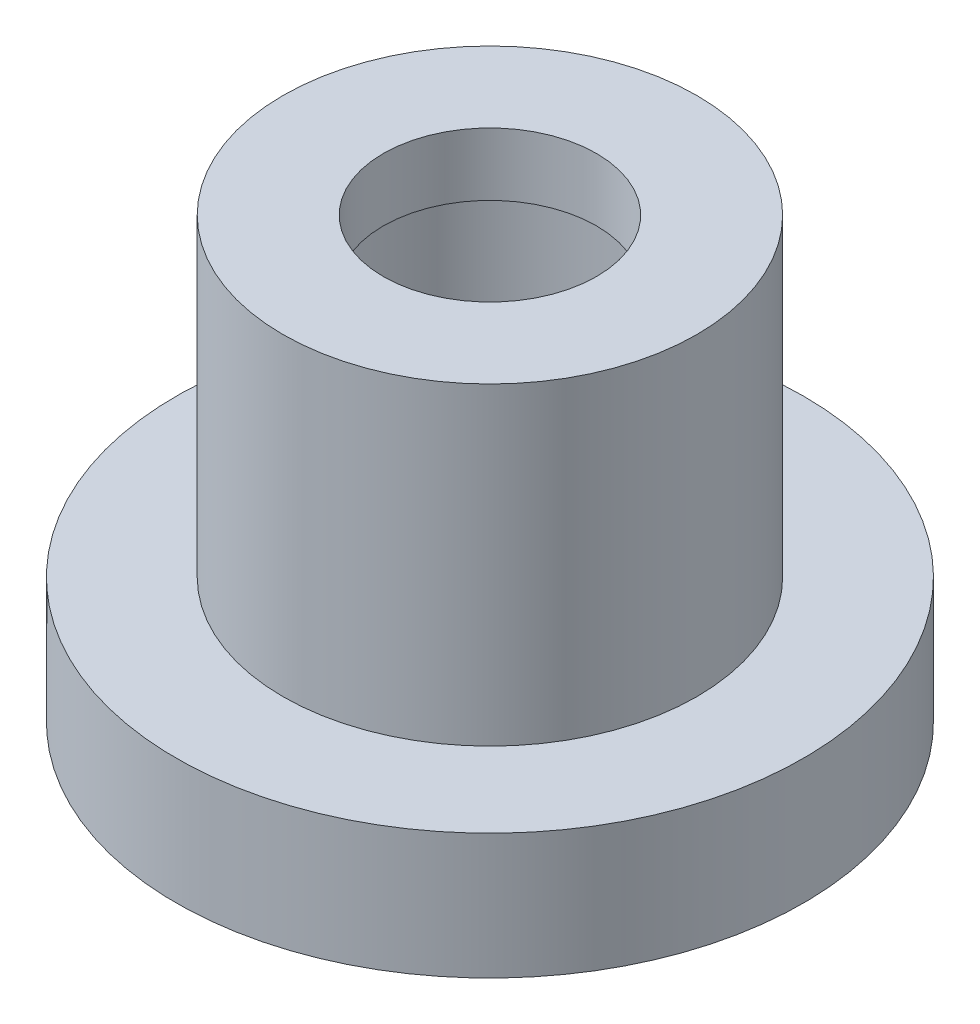
ISO-10303-21;
HEADER;
FILE_DESCRIPTION(('STEP AP214'),'2;1');
FILE_NAME('part.step','',(''),(''),'','','');
FILE_SCHEMA(('AUTOMOTIVE_DESIGN { 1 0 10303 214 1 1 1 1 }'));
ENDSEC;
DATA;
#1=APPLICATION_CONTEXT('core data for automotive mechanical design processes');
#2=APPLICATION_PROTOCOL_DEFINITION('international standard','automotive_design',2000,#1);
#3=PRODUCT_CONTEXT('',#1,'mechanical');
#4=PRODUCT('Part','Part','',(#3));
#5=PRODUCT_RELATED_PRODUCT_CATEGORY('part','',(#4));
#6=PRODUCT_DEFINITION_FORMATION('','',#4);
#7=PRODUCT_DEFINITION_CONTEXT('part definition',#1,'design');
#8=PRODUCT_DEFINITION('design','',#6,#7);
#9=PRODUCT_DEFINITION_SHAPE('','',#8);
#10=(LENGTH_UNIT() NAMED_UNIT(*) SI_UNIT(.MILLI.,.METRE.));
#11=(NAMED_UNIT(*) PLANE_ANGLE_UNIT() SI_UNIT($,.RADIAN.));
#12=(NAMED_UNIT(*) SI_UNIT($,.STERADIAN.) SOLID_ANGLE_UNIT());
#13=UNCERTAINTY_MEASURE_WITH_UNIT(LENGTH_MEASURE(1.E-05),#10,'distance_accuracy_value','');
#14=(GEOMETRIC_REPRESENTATION_CONTEXT(3) GLOBAL_UNCERTAINTY_ASSIGNED_CONTEXT((#13)) GLOBAL_UNIT_ASSIGNED_CONTEXT((#10,
#11,#12)) REPRESENTATION_CONTEXT('',''));
#15=CARTESIAN_POINT('',(0.,0.,0.));
#16=DIRECTION('',(0.,0.,1.));
#17=DIRECTION('',(1.,0.,0.));
#18=AXIS2_PLACEMENT_3D('',#15,#16,#17);
#19=CARTESIAN_POINT('',(0.,7.,0.));
#20=DIRECTION('',(0.,-1.,0.));
#21=DIRECTION('',(0.,0.,-1.));
#22=AXIS2_PLACEMENT_3D('',#19,#20,#21);
#23=CYLINDRICAL_SURFACE('',#22,2.3);
#24=CARTESIAN_POINT('',(0.,0.,0.));
#25=DIRECTION('',(0.,1.,0.));
#26=DIRECTION('',(0.,0.,1.));
#27=AXIS2_PLACEMENT_3D('',#24,#25,#26);
#28=CIRCLE('',#27,2.3);
#29=CARTESIAN_POINT('',(0.,0.,2.3));
#30=VERTEX_POINT('',#29);
#31=EDGE_CURVE('E52',#30,#30,#28,.T.);
#32=ORIENTED_EDGE('',*,*,#31,.F.);
#33=EDGE_LOOP('',(#32));
#34=FACE_BOUND('',#33,.T.);
#35=CARTESIAN_POINT('',(0.,6.,0.));
#36=DIRECTION('',(0.,1.,0.));
#37=DIRECTION('',(0.,0.,1.));
#38=AXIS2_PLACEMENT_3D('',#35,#36,#37);
#39=CIRCLE('',#38,2.3);
#40=CARTESIAN_POINT('',(0.,6.,2.3));
#41=VERTEX_POINT('',#40);
#42=EDGE_CURVE('E64',#41,#41,#39,.T.);
#43=ORIENTED_EDGE('',*,*,#42,.T.);
#44=EDGE_LOOP('',(#43));
#45=FACE_BOUND('',#44,.T.);
#46=ADVANCED_FACE('F39',(#34,#45),#23,.F.);
#47=CARTESIAN_POINT('',(0.,7.,0.));
#48=DIRECTION('',(0.,-1.,0.));
#49=DIRECTION('',(0.,0.,-1.));
#50=AXIS2_PLACEMENT_3D('',#47,#48,#49);
#51=CYLINDRICAL_SURFACE('',#50,3.3);
#52=CARTESIAN_POINT('',(0.,7.,0.));
#53=DIRECTION('',(0.,1.,0.));
#54=DIRECTION('',(0.,0.,1.));
#55=AXIS2_PLACEMENT_3D('',#52,#53,#54);
#56=CIRCLE('',#55,3.3);
#57=CARTESIAN_POINT('',(0.,7.,3.3));
#58=VERTEX_POINT('',#57);
#59=EDGE_CURVE('E47',#58,#58,#56,.T.);
#60=ORIENTED_EDGE('',*,*,#59,.F.);
#61=EDGE_LOOP('',(#60));
#62=FACE_BOUND('',#61,.T.);
#63=CARTESIAN_POINT('',(0.,2.,0.));
#64=DIRECTION('',(0.,-1.,0.));
#65=DIRECTION('',(0.,0.,-1.));
#66=AXIS2_PLACEMENT_3D('',#63,#64,#65);
#67=CIRCLE('',#66,3.3);
#68=CARTESIAN_POINT('',(0.,2.,-3.3));
#69=VERTEX_POINT('',#68);
#70=EDGE_CURVE('E10',#69,#69,#67,.T.);
#71=ORIENTED_EDGE('',*,*,#70,.F.);
#72=EDGE_LOOP('',(#71));
#73=FACE_BOUND('',#72,.T.);
#74=ADVANCED_FACE('F41',(#62,#73),#51,.T.);
#75=CARTESIAN_POINT('',(0.,7.,0.));
#76=DIRECTION('',(0.,1.,0.));
#77=DIRECTION('',(0.,0.,1.));
#78=AXIS2_PLACEMENT_3D('',#75,#76,#77);
#79=PLANE('',#78);
#80=ORIENTED_EDGE('',*,*,#59,.T.);
#81=EDGE_LOOP('',(#80));
#82=FACE_BOUND('',#81,.T.);
#83=CARTESIAN_POINT('',(0.,7.,0.));
#84=DIRECTION('',(0.,1.,0.));
#85=DIRECTION('',(0.,0.,1.));
#86=AXIS2_PLACEMENT_3D('',#83,#84,#85);
#87=CIRCLE('',#86,1.7);
#88=CARTESIAN_POINT('',(0.,7.,1.7));
#89=VERTEX_POINT('',#88);
#90=EDGE_CURVE('E72',#89,#89,#87,.T.);
#91=ORIENTED_EDGE('',*,*,#90,.F.);
#92=EDGE_LOOP('',(#91));
#93=FACE_BOUND('',#92,.T.);
#94=ADVANCED_FACE('F89',(#82,#93),#79,.T.);
#95=CARTESIAN_POINT('',(0.,0.,0.));
#96=DIRECTION('',(0.,1.,0.));
#97=DIRECTION('',(0.,0.,1.));
#98=AXIS2_PLACEMENT_3D('',#95,#96,#97);
#99=PLANE('',#98);
#100=ORIENTED_EDGE('',*,*,#31,.T.);
#101=EDGE_LOOP('',(#100));
#102=FACE_BOUND('',#101,.T.);
#103=CARTESIAN_POINT('',(0.,0.,0.));
#104=DIRECTION('',(0.,-1.,0.));
#105=DIRECTION('',(0.,0.,-1.));
#106=AXIS2_PLACEMENT_3D('',#103,#104,#105);
#107=CIRCLE('',#106,5.);
#108=CARTESIAN_POINT('',(0.,0.,-5.));
#109=VERTEX_POINT('',#108);
#110=EDGE_CURVE('E60',#109,#109,#107,.T.);
#111=ORIENTED_EDGE('',*,*,#110,.T.);
#112=EDGE_LOOP('',(#111));
#113=FACE_BOUND('',#112,.T.);
#114=ADVANCED_FACE('F91',(#102,#113),#99,.F.);
#115=CARTESIAN_POINT('',(0.,2.,0.));
#116=DIRECTION('',(0.,-1.,0.));
#117=DIRECTION('',(0.,0.,-1.));
#118=AXIS2_PLACEMENT_3D('',#115,#116,#117);
#119=CYLINDRICAL_SURFACE('',#118,5.);
#120=CARTESIAN_POINT('',(0.,2.,0.));
#121=DIRECTION('',(0.,-1.,0.));
#122=DIRECTION('',(0.,0.,-1.));
#123=AXIS2_PLACEMENT_3D('',#120,#121,#122);
#124=CIRCLE('',#123,5.);
#125=CARTESIAN_POINT('',(0.,2.,-5.));
#126=VERTEX_POINT('',#125);
#127=EDGE_CURVE('E57',#126,#126,#124,.T.);
#128=ORIENTED_EDGE('',*,*,#127,.T.);
#129=EDGE_LOOP('',(#128));
#130=FACE_BOUND('',#129,.T.);
#131=ORIENTED_EDGE('',*,*,#110,.F.);
#132=EDGE_LOOP('',(#131));
#133=FACE_BOUND('',#132,.T.);
#134=ADVANCED_FACE('F97',(#130,#133),#119,.T.);
#135=CARTESIAN_POINT('',(0.,2.,0.));
#136=DIRECTION('',(0.,-1.,0.));
#137=DIRECTION('',(0.,0.,-1.));
#138=AXIS2_PLACEMENT_3D('',#135,#136,#137);
#139=PLANE('',#138);
#140=ORIENTED_EDGE('',*,*,#70,.T.);
#141=EDGE_LOOP('',(#140));
#142=FACE_BOUND('',#141,.T.);
#143=ORIENTED_EDGE('',*,*,#127,.F.);
#144=EDGE_LOOP('',(#143));
#145=FACE_BOUND('',#144,.T.);
#146=ADVANCED_FACE('F110',(#142,#145),#139,.F.);
#147=CARTESIAN_POINT('',(0.,6.,0.));
#148=DIRECTION('',(0.,1.,0.));
#149=DIRECTION('',(0.,0.,1.));
#150=AXIS2_PLACEMENT_3D('',#147,#148,#149);
#151=PLANE('',#150);
#152=CARTESIAN_POINT('',(0.,6.,0.));
#153=DIRECTION('',(0.,1.,0.));
#154=DIRECTION('',(0.,0.,1.));
#155=AXIS2_PLACEMENT_3D('',#152,#153,#154);
#156=CIRCLE('',#155,1.7);
#157=CARTESIAN_POINT('',(0.,6.,1.7));
#158=VERTEX_POINT('',#157);
#159=EDGE_CURVE('E71',#158,#158,#156,.T.);
#160=ORIENTED_EDGE('',*,*,#159,.T.);
#161=EDGE_LOOP('',(#160));
#162=FACE_BOUND('',#161,.T.);
#163=ORIENTED_EDGE('',*,*,#42,.F.);
#164=EDGE_LOOP('',(#163));
#165=FACE_BOUND('',#164,.T.);
#166=ADVANCED_FACE('F80',(#162,#165),#151,.F.);
#167=CARTESIAN_POINT('',(0.,6.,0.));
#168=DIRECTION('',(0.,1.,0.));
#169=DIRECTION('',(0.,0.,1.));
#170=AXIS2_PLACEMENT_3D('',#167,#168,#169);
#171=CYLINDRICAL_SURFACE('',#170,1.7);
#172=ORIENTED_EDGE('',*,*,#159,.F.);
#173=EDGE_LOOP('',(#172));
#174=FACE_BOUND('',#173,.T.);
#175=ORIENTED_EDGE('',*,*,#90,.T.);
#176=EDGE_LOOP('',(#175));
#177=FACE_BOUND('',#176,.T.);
#178=ADVANCED_FACE('F83',(#174,#177),#171,.F.);
#179=CLOSED_SHELL('',(#46,#74,#94,#114,#134,#146,#166,#178));
#180=MANIFOLD_SOLID_BREP('B2',#179);
#181=ADVANCED_BREP_SHAPE_REPRESENTATION('',(#18,#180),#14);
#182=SHAPE_DEFINITION_REPRESENTATION(#9,#181);
ENDSEC;
END-ISO-10303-21;
